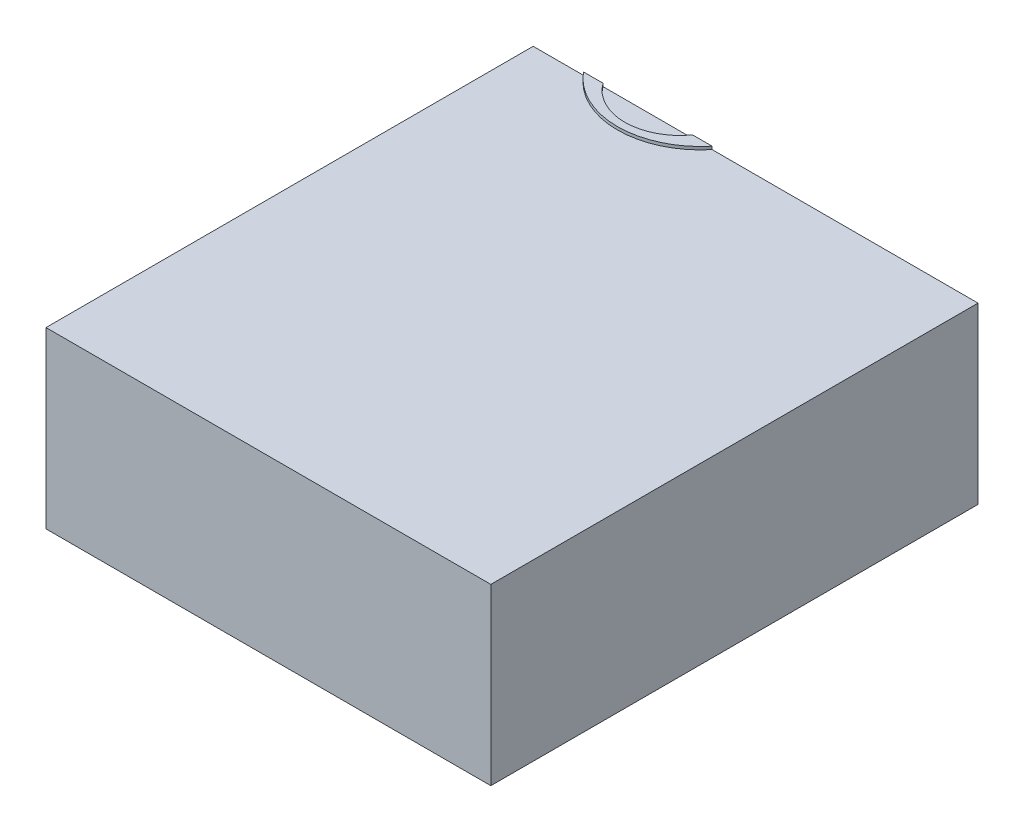
ISO-10303-21;
HEADER;
FILE_DESCRIPTION(('STEP AP214'),'2;1');
FILE_NAME('part.step','',(''),(''),'','','');
FILE_SCHEMA(('AUTOMOTIVE_DESIGN { 1 0 10303 214 1 1 1 1 }'));
ENDSEC;
DATA;
#1=APPLICATION_CONTEXT('core data for automotive mechanical design processes');
#2=APPLICATION_PROTOCOL_DEFINITION('international standard','automotive_design',2000,#1);
#3=PRODUCT_CONTEXT('',#1,'mechanical');
#4=PRODUCT('Part','Part','',(#3));
#5=PRODUCT_RELATED_PRODUCT_CATEGORY('part','',(#4));
#6=PRODUCT_DEFINITION_FORMATION('','',#4);
#7=PRODUCT_DEFINITION_CONTEXT('part definition',#1,'design');
#8=PRODUCT_DEFINITION('design','',#6,#7);
#9=PRODUCT_DEFINITION_SHAPE('','',#8);
#10=(LENGTH_UNIT() NAMED_UNIT(*) SI_UNIT(.MILLI.,.METRE.));
#11=(NAMED_UNIT(*) PLANE_ANGLE_UNIT() SI_UNIT($,.RADIAN.));
#12=(NAMED_UNIT(*) SI_UNIT($,.STERADIAN.) SOLID_ANGLE_UNIT());
#13=UNCERTAINTY_MEASURE_WITH_UNIT(LENGTH_MEASURE(1.E-05),#10,'distance_accuracy_value','');
#14=(GEOMETRIC_REPRESENTATION_CONTEXT(3) GLOBAL_UNCERTAINTY_ASSIGNED_CONTEXT((#13)) GLOBAL_UNIT_ASSIGNED_CONTEXT((#10,
#11,#12)) REPRESENTATION_CONTEXT('',''));
#15=CARTESIAN_POINT('',(0.,0.,0.));
#16=DIRECTION('',(0.,0.,1.));
#17=DIRECTION('',(1.,0.,0.));
#18=AXIS2_PLACEMENT_3D('',#15,#16,#17);
#19=CARTESIAN_POINT('',(0.,1.,0.));
#20=DIRECTION('',(0.,-1.,0.));
#21=DIRECTION('',(0.,0.,-1.));
#22=AXIS2_PLACEMENT_3D('',#19,#20,#21);
#23=CYLINDRICAL_SURFACE('',#22,28.1);
#24=CARTESIAN_POINT('',(0.,1.,0.));
#25=DIRECTION('',(0.,1.,0.));
#26=DIRECTION('',(0.,0.,1.));
#27=AXIS2_PLACEMENT_3D('',#24,#25,#26);
#28=CIRCLE('',#27,28.1);
#29=CARTESIAN_POINT('',(-21.695150517663,1.,17.8586237996086));
#30=VERTEX_POINT('',#29);
#31=CARTESIAN_POINT('',(21.695150517663,1.,17.8586237996086));
#32=VERTEX_POINT('',#31);
#33=EDGE_CURVE('E173',#30,#32,#28,.T.);
#34=ORIENTED_EDGE('',*,*,#33,.F.);
#35=DIRECTION('',(0.,-1.,0.));
#36=VECTOR('',#35,1.);
#37=CARTESIAN_POINT('',(-21.695150517663,1.,17.8586237996086));
#38=LINE('',#37,#36);
#39=CARTESIAN_POINT('',(-21.695150517663,0.,17.8586237996086));
#40=VERTEX_POINT('',#39);
#41=EDGE_CURVE('E229',#30,#40,#38,.T.);
#42=ORIENTED_EDGE('',*,*,#41,.T.);
#43=CARTESIAN_POINT('',(0.,0.,0.));
#44=DIRECTION('',(0.,1.,0.));
#45=DIRECTION('',(0.,0.,1.));
#46=AXIS2_PLACEMENT_3D('',#43,#44,#45);
#47=CIRCLE('',#46,28.1);
#48=CARTESIAN_POINT('',(21.695150517663,0.,17.8586237996086));
#49=VERTEX_POINT('',#48);
#50=EDGE_CURVE('E157',#40,#49,#47,.T.);
#51=ORIENTED_EDGE('',*,*,#50,.T.);
#52=DIRECTION('',(0.,-1.,0.));
#53=VECTOR('',#52,1.);
#54=CARTESIAN_POINT('',(21.695150517663,1.,17.8586237996086));
#55=LINE('',#54,#53);
#56=EDGE_CURVE('E233',#49,#32,#55,.F.);
#57=ORIENTED_EDGE('',*,*,#56,.T.);
#58=EDGE_LOOP('',(#34,#42,#51,#57));
#59=FACE_BOUND('',#58,.T.);
#60=ADVANCED_FACE('F39',(#59),#23,.T.);
#61=CARTESIAN_POINT('',(0.,1.,0.));
#62=DIRECTION('',(0.,1.,0.));
#63=DIRECTION('',(0.,0.,1.));
#64=AXIS2_PLACEMENT_3D('',#61,#62,#63);
#65=PLANE('',#64);
#66=DIRECTION('',(1.,0.,0.));
#67=VECTOR('',#66,1.);
#68=CARTESIAN_POINT('',(0.,1.,17.8586237996086));
#69=LINE('',#68,#67);
#70=CARTESIAN_POINT('',(-15.1013340198333,1.,17.8586237996086));
#71=VERTEX_POINT('',#70);
#72=EDGE_CURVE('E237',#30,#71,#69,.T.);
#73=ORIENTED_EDGE('',*,*,#72,.F.);
#74=ORIENTED_EDGE('',*,*,#33,.T.);
#75=CARTESIAN_POINT('',(15.1013340198333,1.,17.8586237996086));
#76=VERTEX_POINT('',#75);
#77=EDGE_CURVE('E238',#76,#32,#69,.T.);
#78=ORIENTED_EDGE('',*,*,#77,.F.);
#79=CARTESIAN_POINT('',(0.,1.,7.));
#80=DIRECTION('',(0.,1.,0.));
#81=DIRECTION('',(0.,0.,1.));
#82=AXIS2_PLACEMENT_3D('',#79,#80,#81);
#83=CIRCLE('',#82,18.6);
#84=EDGE_CURVE('E168',#71,#76,#83,.T.);
#85=ORIENTED_EDGE('',*,*,#84,.F.);
#86=EDGE_LOOP('',(#73,#74,#78,#85));
#87=FACE_BOUND('',#86,.T.);
#88=ADVANCED_FACE('F266',(#87),#65,.T.);
#89=CARTESIAN_POINT('',(0.,-57.8,7.));
#90=DIRECTION('',(0.,1.,0.));
#91=DIRECTION('',(0.,0.,1.));
#92=AXIS2_PLACEMENT_3D('',#89,#90,#91);
#93=CYLINDRICAL_SURFACE('',#92,18.6);
#94=ORIENTED_EDGE('',*,*,#84,.T.);
#95=DIRECTION('',(0.,1.,0.));
#96=VECTOR('',#95,1.);
#97=CARTESIAN_POINT('',(15.1013340198333,-57.8,17.8586237996086));
#98=LINE('',#97,#96);
#99=CARTESIAN_POINT('',(15.1013340198333,0.,17.8586237996086));
#100=VERTEX_POINT('',#99);
#101=EDGE_CURVE('E241',#76,#100,#98,.F.);
#102=ORIENTED_EDGE('',*,*,#101,.T.);
#103=CARTESIAN_POINT('',(0.,0.,7.));
#104=DIRECTION('',(0.,1.,0.));
#105=DIRECTION('',(0.,0.,1.));
#106=AXIS2_PLACEMENT_3D('',#103,#104,#105);
#107=CIRCLE('',#106,18.6);
#108=CARTESIAN_POINT('',(-15.1013340198333,0.,17.8586237996086));
#109=VERTEX_POINT('',#108);
#110=EDGE_CURVE('E172',#109,#100,#107,.T.);
#111=ORIENTED_EDGE('',*,*,#110,.F.);
#112=DIRECTION('',(0.,1.,0.));
#113=VECTOR('',#112,1.);
#114=CARTESIAN_POINT('',(-15.1013340198333,-57.8,17.8586237996086));
#115=LINE('',#114,#113);
#116=EDGE_CURVE('E245',#109,#71,#115,.T.);
#117=ORIENTED_EDGE('',*,*,#116,.T.);
#118=EDGE_LOOP('',(#94,#102,#111,#117));
#119=FACE_BOUND('',#118,.T.);
#120=ADVANCED_FACE('F264',(#119),#93,.F.);
#121=CARTESIAN_POINT('',(0.,0.,0.));
#122=DIRECTION('',(0.,-1.,0.));
#123=DIRECTION('',(0.,0.,-1.));
#124=AXIS2_PLACEMENT_3D('',#121,#122,#123);
#125=PLANE('',#124);
#126=DIRECTION('',(0.,0.,1.));
#127=VECTOR('',#126,1.);
#128=CARTESIAN_POINT('',(111.341546011374,0.,182.141376200391));
#129=LINE('',#128,#127);
#130=CARTESIAN_POINT('',(111.341546011374,0.,17.8586237996086));
#131=VERTEX_POINT('',#130);
#132=CARTESIAN_POINT('',(111.341546011374,0.,182.141376200391));
#133=VERTEX_POINT('',#132);
#134=EDGE_CURVE('E162',#131,#133,#129,.T.);
#135=ORIENTED_EDGE('',*,*,#134,.F.);
#136=DIRECTION('',(-1.,0.,0.));
#137=VECTOR('',#136,1.);
#138=CARTESIAN_POINT('',(0.,0.,17.8586237996086));
#139=LINE('',#138,#137);
#140=EDGE_CURVE('E224',#131,#49,#139,.T.);
#141=ORIENTED_EDGE('',*,*,#140,.T.);
#142=ORIENTED_EDGE('',*,*,#50,.F.);
#143=CARTESIAN_POINT('',(-38.6584539886258,0.,17.8586237996086));
#144=VERTEX_POINT('',#143);
#145=EDGE_CURVE('E221',#40,#144,#139,.T.);
#146=ORIENTED_EDGE('',*,*,#145,.T.);
#147=DIRECTION('',(0.,0.,1.));
#148=VECTOR('',#147,1.);
#149=CARTESIAN_POINT('',(-38.6584539886258,0.,0.));
#150=LINE('',#149,#148);
#151=CARTESIAN_POINT('',(-38.6584539886258,0.,182.141376200391));
#152=VERTEX_POINT('',#151);
#153=EDGE_CURVE('E190',#144,#152,#150,.T.);
#154=ORIENTED_EDGE('',*,*,#153,.T.);
#155=DIRECTION('',(-1.,0.,0.));
#156=VECTOR('',#155,1.);
#157=CARTESIAN_POINT('',(-111.341546011374,0.,182.141376200391));
#158=LINE('',#157,#156);
#159=EDGE_CURVE('E144',#133,#152,#158,.T.);
#160=ORIENTED_EDGE('',*,*,#159,.F.);
#161=EDGE_LOOP('',(#135,#141,#142,#146,#154,#160));
#162=FACE_BOUND('',#161,.T.);
#163=ADVANCED_FACE('F219',(#162),#125,.F.);
#164=CARTESIAN_POINT('',(0.,-58.8,0.));
#165=DIRECTION('',(0.,-1.,0.));
#166=DIRECTION('',(0.,0.,-1.));
#167=AXIS2_PLACEMENT_3D('',#164,#165,#166);
#168=PLANE('',#167);
#169=DIRECTION('',(0.,0.,1.));
#170=VECTOR('',#169,1.);
#171=CARTESIAN_POINT('',(-38.6584539886258,-58.8,182.141376200391));
#172=LINE('',#171,#170);
#173=CARTESIAN_POINT('',(-38.6584539886258,-58.8,174.272148859892));
#174=VERTEX_POINT('',#173);
#175=CARTESIAN_POINT('',(-38.6584539886258,-58.8,182.141376200391));
#176=VERTEX_POINT('',#175);
#177=EDGE_CURVE('E121',#174,#176,#172,.T.);
#178=ORIENTED_EDGE('',*,*,#177,.F.);
#179=DIRECTION('',(-1.,0.,0.));
#180=VECTOR('',#179,1.);
#181=CARTESIAN_POINT('',(-103.958701758156,-58.8,174.272148859892));
#182=LINE('',#181,#180);
#183=CARTESIAN_POINT('',(103.958701758156,-58.8,174.272148859892));
#184=VERTEX_POINT('',#183);
#185=EDGE_CURVE('E203',#184,#174,#182,.T.);
#186=ORIENTED_EDGE('',*,*,#185,.F.);
#187=DIRECTION('',(0.,0.,1.));
#188=VECTOR('',#187,1.);
#189=CARTESIAN_POINT('',(103.958701758156,-58.8,174.272148859892));
#190=LINE('',#189,#188);
#191=CARTESIAN_POINT('',(103.958701758156,-58.8,17.8586237996086));
#192=VERTEX_POINT('',#191);
#193=EDGE_CURVE('E61',#192,#184,#190,.T.);
#194=ORIENTED_EDGE('',*,*,#193,.F.);
#195=DIRECTION('',(-1.,0.,0.));
#196=VECTOR('',#195,1.);
#197=CARTESIAN_POINT('',(-38.6584539886258,-58.8,17.8586237996086));
#198=LINE('',#197,#196);
#199=CARTESIAN_POINT('',(111.341546011374,-58.8,17.8586237996086));
#200=VERTEX_POINT('',#199);
#201=EDGE_CURVE('E134',#200,#192,#198,.T.);
#202=ORIENTED_EDGE('',*,*,#201,.F.);
#203=DIRECTION('',(0.,0.,1.));
#204=VECTOR('',#203,1.);
#205=CARTESIAN_POINT('',(111.341546011374,-58.8,182.141376200391));
#206=LINE('',#205,#204);
#207=CARTESIAN_POINT('',(111.341546011374,-58.8,182.141376200391));
#208=VERTEX_POINT('',#207);
#209=EDGE_CURVE('E151',#200,#208,#206,.T.);
#210=ORIENTED_EDGE('',*,*,#209,.T.);
#211=DIRECTION('',(-1.,0.,0.));
#212=VECTOR('',#211,1.);
#213=CARTESIAN_POINT('',(-111.341546011374,-58.8,182.141376200391));
#214=LINE('',#213,#212);
#215=EDGE_CURVE('E141',#208,#176,#214,.T.);
#216=ORIENTED_EDGE('',*,*,#215,.T.);
#217=EDGE_LOOP('',(#178,#186,#194,#202,#210,#216));
#218=FACE_BOUND('',#217,.T.);
#219=ADVANCED_FACE('F148',(#218),#168,.T.);
#220=CARTESIAN_POINT('',(-111.341546011374,-58.8,182.141376200391));
#221=DIRECTION('',(0.,0.,-1.));
#222=DIRECTION('',(-1.,0.,0.));
#223=AXIS2_PLACEMENT_3D('',#220,#221,#222);
#224=PLANE('',#223);
#225=ORIENTED_EDGE('',*,*,#159,.T.);
#226=DIRECTION('',(0.,-1.,0.));
#227=VECTOR('',#226,1.);
#228=CARTESIAN_POINT('',(-38.6584539886258,441.2,182.141376200391));
#229=LINE('',#228,#227);
#230=EDGE_CURVE('E125',#152,#176,#229,.T.);
#231=ORIENTED_EDGE('',*,*,#230,.T.);
#232=ORIENTED_EDGE('',*,*,#215,.F.);
#233=DIRECTION('',(0.,1.,0.));
#234=VECTOR('',#233,1.);
#235=CARTESIAN_POINT('',(111.341546011374,-58.8,182.141376200391));
#236=LINE('',#235,#234);
#237=EDGE_CURVE('E153',#208,#133,#236,.T.);
#238=ORIENTED_EDGE('',*,*,#237,.T.);
#239=EDGE_LOOP('',(#225,#231,#232,#238));
#240=FACE_BOUND('',#239,.T.);
#241=ADVANCED_FACE('F139',(#240),#224,.F.);
#242=CARTESIAN_POINT('',(111.341546011374,-58.8,182.141376200391));
#243=DIRECTION('',(-1.,0.,0.));
#244=DIRECTION('',(0.,0.,1.));
#245=AXIS2_PLACEMENT_3D('',#242,#243,#244);
#246=PLANE('',#245);
#247=ORIENTED_EDGE('',*,*,#209,.F.);
#248=DIRECTION('',(0.,-1.,0.));
#249=VECTOR('',#248,1.);
#250=CARTESIAN_POINT('',(111.341546011374,441.2,17.8586237996086));
#251=LINE('',#250,#249);
#252=EDGE_CURVE('E146',#131,#200,#251,.T.);
#253=ORIENTED_EDGE('',*,*,#252,.F.);
#254=ORIENTED_EDGE('',*,*,#134,.T.);
#255=ORIENTED_EDGE('',*,*,#237,.F.);
#256=EDGE_LOOP('',(#247,#253,#254,#255));
#257=FACE_BOUND('',#256,.T.);
#258=ADVANCED_FACE('F215',(#257),#246,.F.);
#259=ORIENTED_EDGE('',*,*,#110,.T.);
#260=DIRECTION('',(-1.,0.,0.));
#261=VECTOR('',#260,1.);
#262=CARTESIAN_POINT('',(0.,0.,17.8586237996086));
#263=LINE('',#262,#261);
#264=EDGE_CURVE('E249',#100,#109,#263,.T.);
#265=ORIENTED_EDGE('',*,*,#264,.T.);
#266=EDGE_LOOP('',(#259,#265));
#267=FACE_BOUND('',#266,.T.);
#268=ADVANCED_FACE('F279',(#267),#125,.F.);
#269=CARTESIAN_POINT('',(103.958701758156,-3.,174.272148859892));
#270=DIRECTION('',(1.,0.,0.));
#271=DIRECTION('',(0.,0.,-1.));
#272=AXIS2_PLACEMENT_3D('',#269,#270,#271);
#273=PLANE('',#272);
#274=DIRECTION('',(0.,0.,1.));
#275=VECTOR('',#274,1.);
#276=CARTESIAN_POINT('',(103.958701758156,-3.,174.272148859892));
#277=LINE('',#276,#275);
#278=CARTESIAN_POINT('',(103.958701758156,-3.,17.8586237996086));
#279=VERTEX_POINT('',#278);
#280=CARTESIAN_POINT('',(103.958701758156,-3.,174.272148859892));
#281=VERTEX_POINT('',#280);
#282=EDGE_CURVE('E197',#279,#281,#277,.T.);
#283=ORIENTED_EDGE('',*,*,#282,.F.);
#284=DIRECTION('',(0.,-1.,0.));
#285=VECTOR('',#284,1.);
#286=CARTESIAN_POINT('',(103.958701758156,-3.,17.8586237996086));
#287=LINE('',#286,#285);
#288=EDGE_CURVE('E54',#279,#192,#287,.T.);
#289=ORIENTED_EDGE('',*,*,#288,.T.);
#290=ORIENTED_EDGE('',*,*,#193,.T.);
#291=DIRECTION('',(0.,-1.,0.));
#292=VECTOR('',#291,1.);
#293=CARTESIAN_POINT('',(103.958701758156,-3.,174.272148859892));
#294=LINE('',#293,#292);
#295=EDGE_CURVE('E165',#281,#184,#294,.T.);
#296=ORIENTED_EDGE('',*,*,#295,.F.);
#297=EDGE_LOOP('',(#283,#289,#290,#296));
#298=FACE_BOUND('',#297,.T.);
#299=ADVANCED_FACE('F286',(#298),#273,.F.);
#300=CARTESIAN_POINT('',(-103.958701758156,-3.,174.272148859892));
#301=DIRECTION('',(0.,0.,1.));
#302=DIRECTION('',(1.,0.,0.));
#303=AXIS2_PLACEMENT_3D('',#300,#301,#302);
#304=PLANE('',#303);
#305=ORIENTED_EDGE('',*,*,#185,.T.);
#306=DIRECTION('',(0.,1.,0.));
#307=VECTOR('',#306,1.);
#308=CARTESIAN_POINT('',(-38.6584539886258,-3.,174.272148859892));
#309=LINE('',#308,#307);
#310=CARTESIAN_POINT('',(-38.6584539886258,-3.,174.272148859892));
#311=VERTEX_POINT('',#310);
#312=EDGE_CURVE('E128',#174,#311,#309,.T.);
#313=ORIENTED_EDGE('',*,*,#312,.T.);
#314=DIRECTION('',(-1.,0.,0.));
#315=VECTOR('',#314,1.);
#316=CARTESIAN_POINT('',(-103.958701758156,-3.,174.272148859892));
#317=LINE('',#316,#315);
#318=EDGE_CURVE('E196',#281,#311,#317,.T.);
#319=ORIENTED_EDGE('',*,*,#318,.F.);
#320=ORIENTED_EDGE('',*,*,#295,.T.);
#321=EDGE_LOOP('',(#305,#313,#319,#320));
#322=FACE_BOUND('',#321,.T.);
#323=ADVANCED_FACE('F210',(#322),#304,.F.);
#324=CARTESIAN_POINT('',(0.,-3.,0.));
#325=DIRECTION('',(0.,-1.,0.));
#326=DIRECTION('',(0.,0.,-1.));
#327=AXIS2_PLACEMENT_3D('',#324,#325,#326);
#328=PLANE('',#327);
#329=DIRECTION('',(0.,0.,1.));
#330=VECTOR('',#329,1.);
#331=CARTESIAN_POINT('',(-38.6584539886258,-3.,0.));
#332=LINE('',#331,#330);
#333=CARTESIAN_POINT('',(-38.6584539886258,-3.,17.8586237996086));
#334=VERTEX_POINT('',#333);
#335=EDGE_CURVE('E11',#334,#311,#332,.T.);
#336=ORIENTED_EDGE('',*,*,#335,.F.);
#337=DIRECTION('',(-1.,0.,0.));
#338=VECTOR('',#337,1.);
#339=CARTESIAN_POINT('',(0.,-3.,17.8586237996086));
#340=LINE('',#339,#338);
#341=EDGE_CURVE('E47',#279,#334,#340,.T.);
#342=ORIENTED_EDGE('',*,*,#341,.F.);
#343=ORIENTED_EDGE('',*,*,#282,.T.);
#344=ORIENTED_EDGE('',*,*,#318,.T.);
#345=EDGE_LOOP('',(#336,#342,#343,#344));
#346=FACE_BOUND('',#345,.T.);
#347=ADVANCED_FACE('F194',(#346),#328,.T.);
#348=CARTESIAN_POINT('',(-38.6584539886258,441.2,182.141376200391));
#349=DIRECTION('',(1.,0.,0.));
#350=DIRECTION('',(0.,0.,-1.));
#351=AXIS2_PLACEMENT_3D('',#348,#349,#350);
#352=PLANE('',#351);
#353=DIRECTION('',(0.,-1.,0.));
#354=VECTOR('',#353,1.);
#355=CARTESIAN_POINT('',(-38.6584539886258,441.2,17.8586237996086));
#356=LINE('',#355,#354);
#357=EDGE_CURVE('E185',#144,#334,#356,.T.);
#358=ORIENTED_EDGE('',*,*,#357,.T.);
#359=ORIENTED_EDGE('',*,*,#335,.T.);
#360=ORIENTED_EDGE('',*,*,#312,.F.);
#361=ORIENTED_EDGE('',*,*,#177,.T.);
#362=ORIENTED_EDGE('',*,*,#230,.F.);
#363=ORIENTED_EDGE('',*,*,#153,.F.);
#364=EDGE_LOOP('',(#358,#359,#360,#361,#362,#363));
#365=FACE_BOUND('',#364,.T.);
#366=ADVANCED_FACE('F124',(#365),#352,.F.);
#367=CARTESIAN_POINT('',(-38.6584539886258,441.2,17.8586237996086));
#368=DIRECTION('',(0.,0.,1.));
#369=DIRECTION('',(1.,0.,0.));
#370=AXIS2_PLACEMENT_3D('',#367,#368,#369);
#371=PLANE('',#370);
#372=ORIENTED_EDGE('',*,*,#252,.T.);
#373=ORIENTED_EDGE('',*,*,#201,.T.);
#374=ORIENTED_EDGE('',*,*,#288,.F.);
#375=ORIENTED_EDGE('',*,*,#341,.T.);
#376=ORIENTED_EDGE('',*,*,#357,.F.);
#377=ORIENTED_EDGE('',*,*,#145,.F.);
#378=ORIENTED_EDGE('',*,*,#41,.F.);
#379=ORIENTED_EDGE('',*,*,#72,.T.);
#380=ORIENTED_EDGE('',*,*,#116,.F.);
#381=ORIENTED_EDGE('',*,*,#264,.F.);
#382=ORIENTED_EDGE('',*,*,#101,.F.);
#383=ORIENTED_EDGE('',*,*,#77,.T.);
#384=ORIENTED_EDGE('',*,*,#56,.F.);
#385=ORIENTED_EDGE('',*,*,#140,.F.);
#386=EDGE_LOOP('',(#372,#373,#374,#375,#376,#377,#378,#379,#380,#381,#382,#383,#384,#385));
#387=FACE_BOUND('',#386,.T.);
#388=ADVANCED_FACE('F184',(#387),#371,.F.);
#389=CLOSED_SHELL('',(#60,#88,#120,#163,#219,#241,#258,#268,#299,#323,#347,#366,#388));
#390=MANIFOLD_SOLID_BREP('B2',#389);
#391=ADVANCED_BREP_SHAPE_REPRESENTATION('',(#18,#390),#14);
#392=SHAPE_DEFINITION_REPRESENTATION(#9,#391);
ENDSEC;
END-ISO-10303-21;
